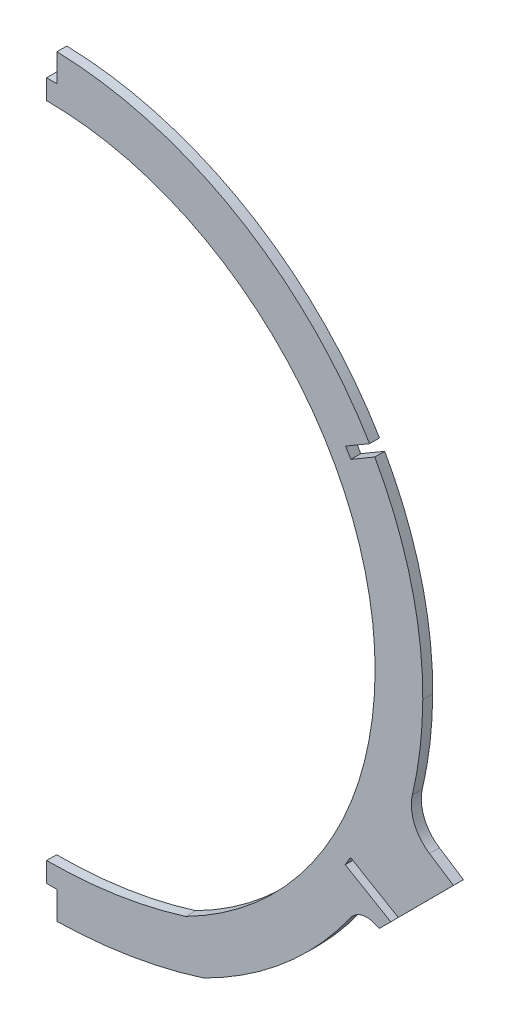
ISO-10303-21;
HEADER;
FILE_DESCRIPTION(('STEP AP214'),'2;1');
FILE_NAME('part.step','',(''),(''),'','','');
FILE_SCHEMA(('AUTOMOTIVE_DESIGN { 1 0 10303 214 1 1 1 1 }'));
ENDSEC;
DATA;
#1=APPLICATION_CONTEXT('core data for automotive mechanical design processes');
#2=APPLICATION_PROTOCOL_DEFINITION('international standard','automotive_design',2000,#1);
#3=PRODUCT_CONTEXT('',#1,'mechanical');
#4=PRODUCT('Part','Part','',(#3));
#5=PRODUCT_RELATED_PRODUCT_CATEGORY('part','',(#4));
#6=PRODUCT_DEFINITION_FORMATION('','',#4);
#7=PRODUCT_DEFINITION_CONTEXT('part definition',#1,'design');
#8=PRODUCT_DEFINITION('design','',#6,#7);
#9=PRODUCT_DEFINITION_SHAPE('','',#8);
#10=(LENGTH_UNIT() NAMED_UNIT(*) SI_UNIT(.MILLI.,.METRE.));
#11=(NAMED_UNIT(*) PLANE_ANGLE_UNIT() SI_UNIT($,.RADIAN.));
#12=(NAMED_UNIT(*) SI_UNIT($,.STERADIAN.) SOLID_ANGLE_UNIT());
#13=UNCERTAINTY_MEASURE_WITH_UNIT(LENGTH_MEASURE(1.E-05),#10,'distance_accuracy_value','');
#14=(GEOMETRIC_REPRESENTATION_CONTEXT(3) GLOBAL_UNCERTAINTY_ASSIGNED_CONTEXT((#13)) GLOBAL_UNIT_ASSIGNED_CONTEXT((#10,
#11,#12)) REPRESENTATION_CONTEXT('',''));
#15=CARTESIAN_POINT('',(0.,0.,0.));
#16=DIRECTION('',(0.,0.,1.));
#17=DIRECTION('',(1.,0.,0.));
#18=AXIS2_PLACEMENT_3D('',#15,#16,#17);
#19=CARTESIAN_POINT('',(0.0533981517267298,19.05,1.5875));
#20=DIRECTION('',(0.,0.,-1.));
#21=DIRECTION('',(-1.,0.,0.));
#22=AXIS2_PLACEMENT_3D('',#19,#20,#21);
#23=CYLINDRICAL_SURFACE('',#22,120.152293878386);
#24=CARTESIAN_POINT('',(0.0533981517267298,19.05,-1.5875));
#25=DIRECTION('',(0.,0.,1.));
#26=DIRECTION('',(-1.,0.,0.));
#27=AXIS2_PLACEMENT_3D('',#24,#25,#26);
#28=CIRCLE('',#27,120.152293878386);
#29=CARTESIAN_POINT('',(120.203613721784,18.3433015446214,-1.5875));
#30=VERTEX_POINT('',#29);
#31=CARTESIAN_POINT('',(104.86215862577,77.8011485175621,-1.5875));
#32=VERTEX_POINT('',#31);
#33=EDGE_CURVE('E347',#30,#32,#28,.T.);
#34=ORIENTED_EDGE('',*,*,#33,.T.);
#35=DIRECTION('',(0.,0.,-1.));
#36=VECTOR('',#35,1.);
#37=CARTESIAN_POINT('',(104.86215862577,77.8011485175621,1.5875));
#38=LINE('',#37,#36);
#39=CARTESIAN_POINT('',(104.86215862577,77.8011485175621,1.5875));
#40=VERTEX_POINT('',#39);
#41=EDGE_CURVE('E397',#32,#40,#38,.F.);
#42=ORIENTED_EDGE('',*,*,#41,.T.);
#43=CARTESIAN_POINT('',(0.0533981517267298,19.05,1.5875));
#44=DIRECTION('',(0.,0.,1.));
#45=DIRECTION('',(-1.,0.,0.));
#46=AXIS2_PLACEMENT_3D('',#43,#44,#45);
#47=CIRCLE('',#46,120.152293878386);
#48=CARTESIAN_POINT('',(120.203613721784,18.3433015446214,1.5875));
#49=VERTEX_POINT('',#48);
#50=EDGE_CURVE('E352',#49,#40,#47,.T.);
#51=ORIENTED_EDGE('',*,*,#50,.F.);
#52=DIRECTION('',(0.,0.,-1.));
#53=VECTOR('',#52,1.);
#54=CARTESIAN_POINT('',(120.203613721784,18.3433015446214,1.5875));
#55=LINE('',#54,#53);
#56=EDGE_CURVE('E355',#49,#30,#55,.T.);
#57=ORIENTED_EDGE('',*,*,#56,.T.);
#58=EDGE_LOOP('',(#34,#42,#51,#57));
#59=FACE_BOUND('',#58,.T.);
#60=ADVANCED_FACE('F36',(#59),#23,.T.);
#61=CARTESIAN_POINT('',(106.258152496254,-51.9886833193289,1.5875));
#62=DIRECTION('',(-0.708097112528265,0.70611506089952,0.));
#63=DIRECTION('',(-0.70611506089952,-0.708097112528265,0.));
#64=AXIS2_PLACEMENT_3D('',#61,#62,#63);
#65=PLANE('',#64);
#66=DIRECTION('',(0.70611506089952,0.708097112528265,0.));
#67=VECTOR('',#66,1.);
#68=CARTESIAN_POINT('',(106.258152496254,-51.9886833193289,-1.5875));
#69=LINE('',#68,#67);
#70=CARTESIAN_POINT('',(106.258152496254,-51.9886833193289,-1.5875));
#71=VERTEX_POINT('',#70);
#72=CARTESIAN_POINT('',(109.962976420149,-48.2734600247094,-1.5875));
#73=VERTEX_POINT('',#72);
#74=EDGE_CURVE('E304',#71,#73,#69,.T.);
#75=ORIENTED_EDGE('',*,*,#74,.T.);
#76=DIRECTION('',(0.,0.,1.));
#77=VECTOR('',#76,1.);
#78=CARTESIAN_POINT('',(109.962976420149,-48.2734600247095,1.5875));
#79=LINE('',#78,#77);
#80=CARTESIAN_POINT('',(109.962976420149,-48.2734600247094,1.5875));
#81=VERTEX_POINT('',#80);
#82=EDGE_CURVE('E392',#73,#81,#79,.T.);
#83=ORIENTED_EDGE('',*,*,#82,.T.);
#84=DIRECTION('',(0.70611506089952,0.708097112528265,0.));
#85=VECTOR('',#84,1.);
#86=CARTESIAN_POINT('',(106.258152496254,-51.9886833193289,1.5875));
#87=LINE('',#86,#85);
#88=CARTESIAN_POINT('',(106.258152496254,-51.9886833193289,1.5875));
#89=VERTEX_POINT('',#88);
#90=EDGE_CURVE('E295',#89,#81,#87,.T.);
#91=ORIENTED_EDGE('',*,*,#90,.F.);
#92=DIRECTION('',(0.,0.,-1.));
#93=VECTOR('',#92,1.);
#94=CARTESIAN_POINT('',(106.258152496254,-51.9886833193289,1.5875));
#95=LINE('',#94,#93);
#96=EDGE_CURVE('E311',#89,#71,#95,.T.);
#97=ORIENTED_EDGE('',*,*,#96,.T.);
#98=EDGE_LOOP('',(#75,#83,#91,#97));
#99=FACE_BOUND('',#98,.T.);
#100=ADVANCED_FACE('F449',(#99),#65,.F.);
#101=CARTESIAN_POINT('',(-5.64062361813422,19.0834910459425,1.5875));
#102=DIRECTION('',(0.,0.,-1.));
#103=DIRECTION('',(-1.,0.,0.));
#104=AXIS2_PLACEMENT_3D('',#101,#102,#103);
#105=CYLINDRICAL_SURFACE('',#104,125.846414141094);
#106=CARTESIAN_POINT('',(-5.64062361813422,19.0834910459425,-1.5875));
#107=DIRECTION('',(0.,0.,1.));
#108=DIRECTION('',(-1.,0.,0.));
#109=AXIS2_PLACEMENT_3D('',#106,#107,#108);
#110=CIRCLE('',#109,125.846414141094);
#111=CARTESIAN_POINT('',(50.138751442251,-93.726,-1.5875));
#112=VERTEX_POINT('',#111);
#113=CARTESIAN_POINT('',(97.1439741619348,-53.5294996056009,-1.5875));
#114=VERTEX_POINT('',#113);
#115=EDGE_CURVE('E358',#112,#114,#110,.T.);
#116=ORIENTED_EDGE('',*,*,#115,.T.);
#117=DIRECTION('',(0.,0.,-1.));
#118=VECTOR('',#117,1.);
#119=CARTESIAN_POINT('',(97.1439741619348,-53.5294996056009,1.5875));
#120=LINE('',#119,#118);
#121=CARTESIAN_POINT('',(97.1439741619348,-53.5294996056009,1.5875));
#122=VERTEX_POINT('',#121);
#123=EDGE_CURVE('E374',#114,#122,#120,.F.);
#124=ORIENTED_EDGE('',*,*,#123,.T.);
#125=CARTESIAN_POINT('',(-5.64062361813422,19.0834910459425,1.5875));
#126=DIRECTION('',(0.,0.,1.));
#127=DIRECTION('',(-1.,0.,0.));
#128=AXIS2_PLACEMENT_3D('',#125,#126,#127);
#129=CIRCLE('',#128,125.846414141094);
#130=CARTESIAN_POINT('',(50.138751442251,-93.726,1.5875));
#131=VERTEX_POINT('',#130);
#132=EDGE_CURVE('E348',#131,#122,#129,.T.);
#133=ORIENTED_EDGE('',*,*,#132,.F.);
#134=DIRECTION('',(0.,0.,-1.));
#135=VECTOR('',#134,1.);
#136=CARTESIAN_POINT('',(50.138751442251,-93.726,1.5875));
#137=LINE('',#136,#135);
#138=EDGE_CURVE('E366',#131,#112,#137,.T.);
#139=ORIENTED_EDGE('',*,*,#138,.T.);
#140=EDGE_LOOP('',(#116,#124,#133,#139));
#141=FACE_BOUND('',#140,.T.);
#142=ADVANCED_FACE('F461',(#141),#105,.T.);
#143=CARTESIAN_POINT('',(116.88560448143,-9.63311355601474,1.5875));
#144=VERTEX_POINT('',#143);
#145=EDGE_CURVE('E346',#144,#49,#129,.T.);
#146=ORIENTED_EDGE('',*,*,#145,.F.);
#147=DIRECTION('',(0.,0.,-1.));
#148=VECTOR('',#147,1.);
#149=CARTESIAN_POINT('',(116.88560448143,-9.63311355601474,1.5875));
#150=LINE('',#149,#148);
#151=CARTESIAN_POINT('',(116.88560448143,-9.63311355601474,-1.5875));
#152=VERTEX_POINT('',#151);
#153=EDGE_CURVE('E380',#144,#152,#150,.T.);
#154=ORIENTED_EDGE('',*,*,#153,.T.);
#155=EDGE_CURVE('E357',#152,#30,#110,.T.);
#156=ORIENTED_EDGE('',*,*,#155,.T.);
#157=ORIENTED_EDGE('',*,*,#56,.F.);
#158=EDGE_LOOP('',(#146,#154,#156,#157));
#159=FACE_BOUND('',#158,.T.);
#160=ADVANCED_FACE('F421',(#159),#105,.T.);
#161=CARTESIAN_POINT('',(2.87745258300709,41.275,1.5875));
#162=DIRECTION('',(0.,0.,1.));
#163=DIRECTION('',(1.,0.,0.));
#164=AXIS2_PLACEMENT_3D('',#161,#162,#163);
#165=PLANE('',#164);
#166=DIRECTION('',(0.,1.,0.));
#167=VECTOR('',#166,1.);
#168=CARTESIAN_POINT('',(3.302,130.312280289149,1.5875));
#169=LINE('',#168,#167);
#170=CARTESIAN_POINT('',(3.302,130.312280289149,1.5875));
#171=VERTEX_POINT('',#170);
#172=CARTESIAN_POINT('',(3.302,139.158369026765,1.5875));
#173=VERTEX_POINT('',#172);
#174=EDGE_CURVE('E229',#171,#173,#169,.T.);
#175=ORIENTED_EDGE('',*,*,#174,.F.);
#176=DIRECTION('',(1.,0.,0.));
#177=VECTOR('',#176,1.);
#178=CARTESIAN_POINT('',(0.,130.312280289149,1.5875));
#179=LINE('',#178,#177);
#180=CARTESIAN_POINT('',(0.,130.312280289149,1.5875));
#181=VERTEX_POINT('',#180);
#182=EDGE_CURVE('E211',#181,#171,#179,.T.);
#183=ORIENTED_EDGE('',*,*,#182,.F.);
#184=DIRECTION('',(0.,1.,0.));
#185=VECTOR('',#184,1.);
#186=CARTESIAN_POINT('',(0.,41.275,1.5875));
#187=LINE('',#186,#185);
#188=CARTESIAN_POINT('',(0.,123.962280289149,1.5875));
#189=VERTEX_POINT('',#188);
#190=EDGE_CURVE('E315',#189,#181,#187,.T.);
#191=ORIENTED_EDGE('',*,*,#190,.F.);
#192=CARTESIAN_POINT('',(0.0533981517267298,19.05,1.5875));
#193=DIRECTION('',(0.,0.,1.));
#194=DIRECTION('',(-1.,0.,0.));
#195=AXIS2_PLACEMENT_3D('',#192,#193,#194);
#196=CIRCLE('',#195,104.912293878419);
#197=CARTESIAN_POINT('',(104.963877332422,18.4329384888053,1.5875));
#198=VERTEX_POINT('',#197);
#199=EDGE_CURVE('E329',#198,#189,#196,.T.);
#200=ORIENTED_EDGE('',*,*,#199,.F.);
#201=CARTESIAN_POINT('',(-5.64062361813422,19.0834910459425,1.5875));
#202=DIRECTION('',(0.,0.,1.));
#203=DIRECTION('',(-1.,0.,0.));
#204=AXIS2_PLACEMENT_3D('',#201,#202,#203);
#205=CIRCLE('',#204,110.60641414112);
#206=CARTESIAN_POINT('',(44.4048605696805,-79.5533598849547,1.5875));
#207=VERTEX_POINT('',#206);
#208=EDGE_CURVE('E325',#207,#198,#205,.T.);
#209=ORIENTED_EDGE('',*,*,#208,.F.);
#210=CARTESIAN_POINT('',(0.0401740981522854,63.5,1.5875));
#211=DIRECTION('',(0.,0.,1.));
#212=DIRECTION('',(1.,0.,0.));
#213=AXIS2_PLACEMENT_3D('',#210,#211,#212);
#214=CIRCLE('',#213,149.774794875837);
#215=CARTESIAN_POINT('',(0.,-86.2747894878867,1.5875));
#216=VERTEX_POINT('',#215);
#217=EDGE_CURVE('E323',#216,#207,#214,.T.);
#218=ORIENTED_EDGE('',*,*,#217,.F.);
#219=CARTESIAN_POINT('',(0.,-92.6247894878867,1.5875));
#220=VERTEX_POINT('',#219);
#221=EDGE_CURVE('E320',#220,#216,#187,.T.);
#222=ORIENTED_EDGE('',*,*,#221,.F.);
#223=DIRECTION('',(-1.,0.,0.));
#224=VECTOR('',#223,1.);
#225=CARTESIAN_POINT('',(0.,-92.6247894878867,1.5875));
#226=LINE('',#225,#224);
#227=CARTESIAN_POINT('',(3.302,-92.6247894878867,1.5875));
#228=VERTEX_POINT('',#227);
#229=EDGE_CURVE('E283',#228,#220,#226,.T.);
#230=ORIENTED_EDGE('',*,*,#229,.F.);
#231=DIRECTION('',(0.,1.,0.));
#232=VECTOR('',#231,1.);
#233=CARTESIAN_POINT('',(3.302,-92.6247894878867,1.5875));
#234=LINE('',#233,#232);
#235=CARTESIAN_POINT('',(3.302,-101.48255368279,1.5875));
#236=VERTEX_POINT('',#235);
#237=EDGE_CURVE('E261',#236,#228,#234,.T.);
#238=ORIENTED_EDGE('',*,*,#237,.F.);
#239=CARTESIAN_POINT('',(0.0401740981522854,63.5,1.5875));
#240=DIRECTION('',(0.,0.,1.));
#241=DIRECTION('',(1.,0.,0.));
#242=AXIS2_PLACEMENT_3D('',#239,#240,#241);
#243=CIRCLE('',#242,165.014794875819);
#244=EDGE_CURVE('E344',#236,#131,#243,.T.);
#245=ORIENTED_EDGE('',*,*,#244,.T.);
#246=ORIENTED_EDGE('',*,*,#132,.T.);
#247=CARTESIAN_POINT('',(102.330313402175,-57.1934299113174,1.5875));
#248=DIRECTION('',(0.,0.,1.));
#249=DIRECTION('',(1.,0.,0.));
#250=AXIS2_PLACEMENT_3D('',#247,#248,#249);
#251=CIRCLE('',#250,6.35);
#252=CARTESIAN_POINT('',(104.903780740709,-51.3882799685941,1.5875));
#253=VERTEX_POINT('',#252);
#254=EDGE_CURVE('E378',#122,#253,#251,.F.);
#255=ORIENTED_EDGE('',*,*,#254,.T.);
#256=DIRECTION('',(0.914196841373741,-0.405270447013195,0.));
#257=VECTOR('',#256,1.);
#258=CARTESIAN_POINT('',(106.258152496254,-51.9886833193289,1.5875));
#259=LINE('',#258,#257);
#260=EDGE_CURVE('E291',#253,#89,#259,.T.);
#261=ORIENTED_EDGE('',*,*,#260,.T.);
#262=ORIENTED_EDGE('',*,*,#90,.T.);
#263=DIRECTION('',(0.862448043896424,-0.506145603141262,0.));
#264=VECTOR('',#263,1.);
#265=CARTESIAN_POINT('',(95.4242526258856,-39.741107060575,1.5875));
#266=LINE('',#265,#264);
#267=CARTESIAN_POINT('',(95.4242526258856,-39.741107060575,1.5875));
#268=VERTEX_POINT('',#267);
#269=EDGE_CURVE('E242',#268,#81,#266,.T.);
#270=ORIENTED_EDGE('',*,*,#269,.F.);
#271=DIRECTION('',(-0.506145603141263,-0.862448043896423,0.));
#272=VECTOR('',#271,1.);
#273=CARTESIAN_POINT('',(95.4242526258856,-39.741107060575,1.5875));
#274=LINE('',#273,#272);
#275=CARTESIAN_POINT('',(97.095545407458,-36.893303619629,1.5875));
#276=VERTEX_POINT('',#275);
#277=EDGE_CURVE('E262',#276,#268,#274,.T.);
#278=ORIENTED_EDGE('',*,*,#277,.F.);
#279=DIRECTION('',(-0.862448043896424,0.506145603141262,0.));
#280=VECTOR('',#279,1.);
#281=CARTESIAN_POINT('',(97.095545407458,-36.893303619629,1.5875));
#282=LINE('',#281,#280);
#283=CARTESIAN_POINT('',(112.371411886049,-45.8582641259811,1.5875));
#284=VERTEX_POINT('',#283);
#285=EDGE_CURVE('E265',#284,#276,#282,.T.);
#286=ORIENTED_EDGE('',*,*,#285,.F.);
#287=CARTESIAN_POINT('',(130.011728615408,-28.1684313610053,1.5875));
#288=VERTEX_POINT('',#287);
#289=EDGE_CURVE('E293',#284,#288,#87,.T.);
#290=ORIENTED_EDGE('',*,*,#289,.T.);
#291=DIRECTION('',(-0.838670567945427,0.544639035015022,0.));
#292=VECTOR('',#291,1.);
#293=CARTESIAN_POINT('',(130.011728615408,-28.1684313610053,1.5875));
#294=LINE('',#293,#292);
#295=CARTESIAN_POINT('',(122.333626645259,-23.1822136402457,1.5875));
#296=VERTEX_POINT('',#295);
#297=EDGE_CURVE('E298',#288,#296,#294,.T.);
#298=ORIENTED_EDGE('',*,*,#297,.T.);
#299=CARTESIAN_POINT('',(129.25054238995,-12.5310974273388,1.5875));
#300=DIRECTION('',(0.,0.,1.));
#301=DIRECTION('',(1.,0.,0.));
#302=AXIS2_PLACEMENT_3D('',#299,#300,#301);
#303=CIRCLE('',#302,12.7);
#304=EDGE_CURVE('E387',#296,#144,#303,.F.);
#305=ORIENTED_EDGE('',*,*,#304,.T.);
#306=ORIENTED_EDGE('',*,*,#145,.T.);
#307=ORIENTED_EDGE('',*,*,#50,.T.);
#308=DIRECTION('',(0.862448035610579,0.506145617259948,0.));
#309=VECTOR('',#308,1.);
#310=CARTESIAN_POINT('',(108.16621800195,79.7402046732599,1.5875));
#311=LINE('',#310,#309);
#312=CARTESIAN_POINT('',(97.2131279496957,73.3121553340585,1.5875));
#313=VERTEX_POINT('',#312);
#314=EDGE_CURVE('E233',#313,#40,#311,.T.);
#315=ORIENTED_EDGE('',*,*,#314,.F.);
#316=DIRECTION('',(0.506145617259947,-0.862448035610579,0.));
#317=VECTOR('',#316,1.);
#318=CARTESIAN_POINT('',(97.2131279496957,73.3121553340585,1.5875));
#319=LINE('',#318,#317);
#320=CARTESIAN_POINT('',(95.5418351215034,76.1599587476446,1.5875));
#321=VERTEX_POINT('',#320);
#322=EDGE_CURVE('E243',#321,#313,#319,.T.);
#323=ORIENTED_EDGE('',*,*,#322,.F.);
#324=DIRECTION('',(-0.862448035610579,-0.506145617259948,0.));
#325=VECTOR('',#324,1.);
#326=CARTESIAN_POINT('',(106.494925173758,82.588008086846,1.5875));
#327=LINE('',#326,#325);
#328=CARTESIAN_POINT('',(103.208114984354,80.6590749761637,1.5875));
#329=VERTEX_POINT('',#328);
#330=EDGE_CURVE('E246',#329,#321,#327,.T.);
#331=ORIENTED_EDGE('',*,*,#330,.F.);
#332=EDGE_CURVE('E351',#329,#173,#47,.T.);
#333=ORIENTED_EDGE('',*,*,#332,.T.);
#334=EDGE_LOOP('',(#175,#183,#191,#200,#209,#218,#222,#230,#238,#245,#246,#255,#261,#262,#270,
#278,#286,#290,#298,#305,#306,#307,#315,#323,#331,#333));
#335=FACE_BOUND('',#334,.T.);
#336=ADVANCED_FACE('F405',(#335),#165,.T.);
#337=CARTESIAN_POINT('',(2.87745258300709,41.275,-1.5875));
#338=DIRECTION('',(0.,0.,1.));
#339=DIRECTION('',(1.,0.,0.));
#340=AXIS2_PLACEMENT_3D('',#337,#338,#339);
#341=PLANE('',#340);
#342=DIRECTION('',(1.,0.,0.));
#343=VECTOR('',#342,1.);
#344=CARTESIAN_POINT('',(0.,130.312280289149,-1.5875));
#345=LINE('',#344,#343);
#346=CARTESIAN_POINT('',(0.,130.312280289149,-1.5875));
#347=VERTEX_POINT('',#346);
#348=CARTESIAN_POINT('',(3.302,130.312280289149,-1.5875));
#349=VERTEX_POINT('',#348);
#350=EDGE_CURVE('E59',#347,#349,#345,.T.);
#351=ORIENTED_EDGE('',*,*,#350,.T.);
#352=DIRECTION('',(0.,1.,0.));
#353=VECTOR('',#352,1.);
#354=CARTESIAN_POINT('',(3.302,130.312280289149,-1.5875));
#355=LINE('',#354,#353);
#356=CARTESIAN_POINT('',(3.302,139.158369026765,-1.5875));
#357=VERTEX_POINT('',#356);
#358=EDGE_CURVE('E218',#349,#357,#355,.T.);
#359=ORIENTED_EDGE('',*,*,#358,.T.);
#360=CARTESIAN_POINT('',(103.208114984354,80.6590749761637,-1.5875));
#361=VERTEX_POINT('',#360);
#362=EDGE_CURVE('E361',#361,#357,#28,.T.);
#363=ORIENTED_EDGE('',*,*,#362,.F.);
#364=DIRECTION('',(-0.862448035610579,-0.506145617259948,0.));
#365=VECTOR('',#364,1.);
#366=CARTESIAN_POINT('',(106.494925173758,82.588008086846,-1.5875));
#367=LINE('',#366,#365);
#368=CARTESIAN_POINT('',(95.5418351215034,76.1599587476446,-1.5875));
#369=VERTEX_POINT('',#368);
#370=EDGE_CURVE('E51',#361,#369,#367,.T.);
#371=ORIENTED_EDGE('',*,*,#370,.T.);
#372=DIRECTION('',(0.506145617259947,-0.862448035610579,0.));
#373=VECTOR('',#372,1.);
#374=CARTESIAN_POINT('',(97.2131279496957,73.3121553340585,-1.5875));
#375=LINE('',#374,#373);
#376=CARTESIAN_POINT('',(97.2131279496957,73.3121553340585,-1.5875));
#377=VERTEX_POINT('',#376);
#378=EDGE_CURVE('E239',#369,#377,#375,.T.);
#379=ORIENTED_EDGE('',*,*,#378,.T.);
#380=DIRECTION('',(0.862448035610579,0.506145617259948,0.));
#381=VECTOR('',#380,1.);
#382=CARTESIAN_POINT('',(108.16621800195,79.7402046732599,-1.5875));
#383=LINE('',#382,#381);
#384=EDGE_CURVE('E247',#377,#32,#383,.T.);
#385=ORIENTED_EDGE('',*,*,#384,.T.);
#386=ORIENTED_EDGE('',*,*,#33,.F.);
#387=ORIENTED_EDGE('',*,*,#155,.F.);
#388=CARTESIAN_POINT('',(129.25054238995,-12.5310974273388,-1.5875));
#389=DIRECTION('',(0.,0.,1.));
#390=DIRECTION('',(1.,0.,0.));
#391=AXIS2_PLACEMENT_3D('',#388,#389,#390);
#392=CIRCLE('',#391,12.7);
#393=CARTESIAN_POINT('',(122.333626645259,-23.1822136402457,-1.5875));
#394=VERTEX_POINT('',#393);
#395=EDGE_CURVE('E385',#152,#394,#392,.T.);
#396=ORIENTED_EDGE('',*,*,#395,.T.);
#397=DIRECTION('',(-0.838670567945427,0.544639035015022,0.));
#398=VECTOR('',#397,1.);
#399=CARTESIAN_POINT('',(130.011728615408,-28.1684313610053,-1.5875));
#400=LINE('',#399,#398);
#401=CARTESIAN_POINT('',(130.011728615408,-28.1684313610053,-1.5875));
#402=VERTEX_POINT('',#401);
#403=EDGE_CURVE('E294',#402,#394,#400,.T.);
#404=ORIENTED_EDGE('',*,*,#403,.F.);
#405=CARTESIAN_POINT('',(112.371411886049,-45.8582641259811,-1.5875));
#406=VERTEX_POINT('',#405);
#407=EDGE_CURVE('E303',#406,#402,#69,.T.);
#408=ORIENTED_EDGE('',*,*,#407,.F.);
#409=DIRECTION('',(-0.862448043896424,0.506145603141262,0.));
#410=VECTOR('',#409,1.);
#411=CARTESIAN_POINT('',(97.095545407458,-36.893303619629,-1.5875));
#412=LINE('',#411,#410);
#413=CARTESIAN_POINT('',(97.095545407458,-36.893303619629,-1.5875));
#414=VERTEX_POINT('',#413);
#415=EDGE_CURVE('E271',#406,#414,#412,.T.);
#416=ORIENTED_EDGE('',*,*,#415,.T.);
#417=DIRECTION('',(-0.506145603141263,-0.862448043896423,0.));
#418=VECTOR('',#417,1.);
#419=CARTESIAN_POINT('',(95.4242526258856,-39.741107060575,-1.5875));
#420=LINE('',#419,#418);
#421=CARTESIAN_POINT('',(95.4242526258856,-39.741107060575,-1.5875));
#422=VERTEX_POINT('',#421);
#423=EDGE_CURVE('E258',#414,#422,#420,.T.);
#424=ORIENTED_EDGE('',*,*,#423,.T.);
#425=DIRECTION('',(0.862448043896424,-0.506145603141262,0.));
#426=VECTOR('',#425,1.);
#427=CARTESIAN_POINT('',(95.4242526258856,-39.741107060575,-1.5875));
#428=LINE('',#427,#426);
#429=EDGE_CURVE('E266',#422,#73,#428,.T.);
#430=ORIENTED_EDGE('',*,*,#429,.T.);
#431=ORIENTED_EDGE('',*,*,#74,.F.);
#432=DIRECTION('',(0.914196841373741,-0.405270447013195,0.));
#433=VECTOR('',#432,1.);
#434=CARTESIAN_POINT('',(106.258152496254,-51.9886833193289,-1.5875));
#435=LINE('',#434,#433);
#436=CARTESIAN_POINT('',(104.903780740709,-51.3882799685941,-1.5875));
#437=VERTEX_POINT('',#436);
#438=EDGE_CURVE('E214',#437,#71,#435,.T.);
#439=ORIENTED_EDGE('',*,*,#438,.F.);
#440=CARTESIAN_POINT('',(102.330313402175,-57.1934299113174,-1.5875));
#441=DIRECTION('',(0.,0.,1.));
#442=DIRECTION('',(1.,0.,0.));
#443=AXIS2_PLACEMENT_3D('',#440,#441,#442);
#444=CIRCLE('',#443,6.35);
#445=EDGE_CURVE('E376',#437,#114,#444,.T.);
#446=ORIENTED_EDGE('',*,*,#445,.T.);
#447=ORIENTED_EDGE('',*,*,#115,.F.);
#448=CARTESIAN_POINT('',(0.0401740981522854,63.5,-1.5875));
#449=DIRECTION('',(0.,0.,1.));
#450=DIRECTION('',(1.,0.,0.));
#451=AXIS2_PLACEMENT_3D('',#448,#449,#450);
#452=CIRCLE('',#451,165.014794875819);
#453=CARTESIAN_POINT('',(3.302,-101.48255368279,-1.5875));
#454=VERTEX_POINT('',#453);
#455=EDGE_CURVE('E343',#454,#112,#452,.T.);
#456=ORIENTED_EDGE('',*,*,#455,.F.);
#457=DIRECTION('',(0.,1.,0.));
#458=VECTOR('',#457,1.);
#459=CARTESIAN_POINT('',(3.302,-92.6247894878867,-1.5875));
#460=LINE('',#459,#458);
#461=CARTESIAN_POINT('',(3.302,-92.6247894878867,-1.5875));
#462=VERTEX_POINT('',#461);
#463=EDGE_CURVE('E285',#454,#462,#460,.T.);
#464=ORIENTED_EDGE('',*,*,#463,.T.);
#465=DIRECTION('',(-1.,0.,0.));
#466=VECTOR('',#465,1.);
#467=CARTESIAN_POINT('',(0.,-92.6247894878867,-1.5875));
#468=LINE('',#467,#466);
#469=CARTESIAN_POINT('',(0.,-92.6247894878867,-1.5875));
#470=VERTEX_POINT('',#469);
#471=EDGE_CURVE('E279',#462,#470,#468,.T.);
#472=ORIENTED_EDGE('',*,*,#471,.T.);
#473=DIRECTION('',(0.,1.,0.));
#474=VECTOR('',#473,1.);
#475=CARTESIAN_POINT('',(0.,41.275,-1.5875));
#476=LINE('',#475,#474);
#477=CARTESIAN_POINT('',(0.,-86.2747894878867,-1.5875));
#478=VERTEX_POINT('',#477);
#479=EDGE_CURVE('E316',#470,#478,#476,.T.);
#480=ORIENTED_EDGE('',*,*,#479,.T.);
#481=CARTESIAN_POINT('',(0.0401740981522854,63.5,-1.5875));
#482=DIRECTION('',(0.,0.,1.));
#483=DIRECTION('',(1.,0.,0.));
#484=AXIS2_PLACEMENT_3D('',#481,#482,#483);
#485=CIRCLE('',#484,149.774794875837);
#486=CARTESIAN_POINT('',(44.4048605696805,-79.5533598849547,-1.5875));
#487=VERTEX_POINT('',#486);
#488=EDGE_CURVE('E333',#478,#487,#485,.T.);
#489=ORIENTED_EDGE('',*,*,#488,.T.);
#490=CARTESIAN_POINT('',(-5.64062361813422,19.0834910459425,-1.5875));
#491=DIRECTION('',(0.,0.,1.));
#492=DIRECTION('',(-1.,0.,0.));
#493=AXIS2_PLACEMENT_3D('',#490,#491,#492);
#494=CIRCLE('',#493,110.60641414112);
#495=CARTESIAN_POINT('',(104.963877332422,18.4329384888053,-1.5875));
#496=VERTEX_POINT('',#495);
#497=EDGE_CURVE('E335',#487,#496,#494,.T.);
#498=ORIENTED_EDGE('',*,*,#497,.T.);
#499=CARTESIAN_POINT('',(0.0533981517267298,19.05,-1.5875));
#500=DIRECTION('',(0.,0.,1.));
#501=DIRECTION('',(-1.,0.,0.));
#502=AXIS2_PLACEMENT_3D('',#499,#500,#501);
#503=CIRCLE('',#502,104.912293878419);
#504=CARTESIAN_POINT('',(0.,123.962280289149,-1.5875));
#505=VERTEX_POINT('',#504);
#506=EDGE_CURVE('E326',#496,#505,#503,.T.);
#507=ORIENTED_EDGE('',*,*,#506,.T.);
#508=EDGE_CURVE('E228',#505,#347,#476,.T.);
#509=ORIENTED_EDGE('',*,*,#508,.T.);
#510=EDGE_LOOP('',(#351,#359,#363,#371,#379,#385,#386,#387,#396,#404,#408,#416,#424,#430,#431,
#439,#446,#447,#456,#464,#472,#480,#489,#498,#507,#509));
#511=FACE_BOUND('',#510,.T.);
#512=ADVANCED_FACE('F226',(#511),#341,.F.);
#513=CARTESIAN_POINT('',(0.0401740981522854,63.5,1.5875));
#514=DIRECTION('',(0.,0.,-1.));
#515=DIRECTION('',(-1.,0.,0.));
#516=AXIS2_PLACEMENT_3D('',#513,#514,#515);
#517=CYLINDRICAL_SURFACE('',#516,165.014794875819);
#518=ORIENTED_EDGE('',*,*,#244,.F.);
#519=DIRECTION('',(0.,0.,-1.));
#520=VECTOR('',#519,1.);
#521=CARTESIAN_POINT('',(3.302,-101.48255368279,1.5875));
#522=LINE('',#521,#520);
#523=EDGE_CURVE('E11',#236,#454,#522,.T.);
#524=ORIENTED_EDGE('',*,*,#523,.T.);
#525=ORIENTED_EDGE('',*,*,#455,.T.);
#526=ORIENTED_EDGE('',*,*,#138,.F.);
#527=EDGE_LOOP('',(#518,#524,#525,#526));
#528=FACE_BOUND('',#527,.T.);
#529=ADVANCED_FACE('F470',(#528),#517,.T.);
#530=ORIENTED_EDGE('',*,*,#362,.T.);
#531=DIRECTION('',(0.,0.,-1.));
#532=VECTOR('',#531,1.);
#533=CARTESIAN_POINT('',(3.302,139.158369026765,1.5875));
#534=LINE('',#533,#532);
#535=EDGE_CURVE('E44',#357,#173,#534,.F.);
#536=ORIENTED_EDGE('',*,*,#535,.T.);
#537=ORIENTED_EDGE('',*,*,#332,.F.);
#538=DIRECTION('',(0.,0.,-1.));
#539=VECTOR('',#538,1.);
#540=CARTESIAN_POINT('',(103.208114984354,80.6590749761637,1.5875));
#541=LINE('',#540,#539);
#542=EDGE_CURVE('E395',#329,#361,#541,.T.);
#543=ORIENTED_EDGE('',*,*,#542,.T.);
#544=EDGE_LOOP('',(#530,#536,#537,#543));
#545=FACE_BOUND('',#544,.T.);
#546=ADVANCED_FACE('F402',(#545),#23,.T.);
#547=CARTESIAN_POINT('',(0.0401740981522854,63.5,1.5875));
#548=DIRECTION('',(0.,0.,-1.));
#549=DIRECTION('',(-1.,0.,0.));
#550=AXIS2_PLACEMENT_3D('',#547,#548,#549);
#551=CYLINDRICAL_SURFACE('',#550,149.774794875837);
#552=DIRECTION('',(0.,0.,-1.));
#553=VECTOR('',#552,1.);
#554=CARTESIAN_POINT('',(0.,-86.2747894878867,1.5875));
#555=LINE('',#554,#553);
#556=EDGE_CURVE('E319',#216,#478,#555,.T.);
#557=ORIENTED_EDGE('',*,*,#556,.F.);
#558=ORIENTED_EDGE('',*,*,#217,.T.);
#559=DIRECTION('',(0.,0.,-1.));
#560=VECTOR('',#559,1.);
#561=CARTESIAN_POINT('',(44.4048605696805,-79.5533598849547,1.5875));
#562=LINE('',#561,#560);
#563=EDGE_CURVE('E340',#207,#487,#562,.T.);
#564=ORIENTED_EDGE('',*,*,#563,.T.);
#565=ORIENTED_EDGE('',*,*,#488,.F.);
#566=EDGE_LOOP('',(#557,#558,#564,#565));
#567=FACE_BOUND('',#566,.T.);
#568=ADVANCED_FACE('F485',(#567),#551,.F.);
#569=CARTESIAN_POINT('',(-5.64062361813422,19.0834910459425,1.5875));
#570=DIRECTION('',(0.,0.,-1.));
#571=DIRECTION('',(-1.,0.,0.));
#572=AXIS2_PLACEMENT_3D('',#569,#570,#571);
#573=CYLINDRICAL_SURFACE('',#572,110.60641414112);
#574=ORIENTED_EDGE('',*,*,#497,.F.);
#575=ORIENTED_EDGE('',*,*,#563,.F.);
#576=ORIENTED_EDGE('',*,*,#208,.T.);
#577=DIRECTION('',(0.,0.,-1.));
#578=VECTOR('',#577,1.);
#579=CARTESIAN_POINT('',(104.963877332422,18.4329384888053,1.5875));
#580=LINE('',#579,#578);
#581=EDGE_CURVE('E332',#198,#496,#580,.T.);
#582=ORIENTED_EDGE('',*,*,#581,.T.);
#583=EDGE_LOOP('',(#574,#575,#576,#582));
#584=FACE_BOUND('',#583,.T.);
#585=ADVANCED_FACE('F489',(#584),#573,.F.);
#586=CARTESIAN_POINT('',(0.0533981517267298,19.05,1.5875));
#587=DIRECTION('',(0.,0.,-1.));
#588=DIRECTION('',(-1.,0.,0.));
#589=AXIS2_PLACEMENT_3D('',#586,#587,#588);
#590=CYLINDRICAL_SURFACE('',#589,104.912293878419);
#591=DIRECTION('',(0.,0.,-1.));
#592=VECTOR('',#591,1.);
#593=CARTESIAN_POINT('',(0.,123.962280289149,1.5875));
#594=LINE('',#593,#592);
#595=EDGE_CURVE('E369',#505,#189,#594,.F.);
#596=ORIENTED_EDGE('',*,*,#595,.F.);
#597=ORIENTED_EDGE('',*,*,#506,.F.);
#598=ORIENTED_EDGE('',*,*,#581,.F.);
#599=ORIENTED_EDGE('',*,*,#199,.T.);
#600=EDGE_LOOP('',(#596,#597,#598,#599));
#601=FACE_BOUND('',#600,.T.);
#602=ADVANCED_FACE('F493',(#601),#590,.F.);
#603=CARTESIAN_POINT('',(0.,0.,0.));
#604=DIRECTION('',(1.,0.,0.));
#605=DIRECTION('',(0.,0.,-1.));
#606=AXIS2_PLACEMENT_3D('',#603,#604,#605);
#607=PLANE('',#606);
#608=ORIENTED_EDGE('',*,*,#190,.T.);
#609=DIRECTION('',(0.,0.,1.));
#610=VECTOR('',#609,1.);
#611=CARTESIAN_POINT('',(0.,130.312280289149,-1.5875));
#612=LINE('',#611,#610);
#613=EDGE_CURVE('E215',#347,#181,#612,.T.);
#614=ORIENTED_EDGE('',*,*,#613,.F.);
#615=ORIENTED_EDGE('',*,*,#508,.F.);
#616=ORIENTED_EDGE('',*,*,#595,.T.);
#617=EDGE_LOOP('',(#608,#614,#615,#616));
#618=FACE_BOUND('',#617,.T.);
#619=ADVANCED_FACE('F497',(#618),#607,.F.);
#620=ORIENTED_EDGE('',*,*,#479,.F.);
#621=DIRECTION('',(0.,0.,1.));
#622=VECTOR('',#621,1.);
#623=CARTESIAN_POINT('',(0.,-92.6247894878867,-1.5875));
#624=LINE('',#623,#622);
#625=EDGE_CURVE('E280',#470,#220,#624,.T.);
#626=ORIENTED_EDGE('',*,*,#625,.T.);
#627=ORIENTED_EDGE('',*,*,#221,.T.);
#628=ORIENTED_EDGE('',*,*,#556,.T.);
#629=EDGE_LOOP('',(#620,#626,#627,#628));
#630=FACE_BOUND('',#629,.T.);
#631=ADVANCED_FACE('F479',(#630),#607,.F.);
#632=CARTESIAN_POINT('',(106.258152496254,-51.9886833193289,1.5875));
#633=DIRECTION('',(0.405270447013195,0.914196841373741,0.));
#634=DIRECTION('',(-0.914196841373741,0.405270447013195,0.));
#635=AXIS2_PLACEMENT_3D('',#632,#633,#634);
#636=PLANE('',#635);
#637=ORIENTED_EDGE('',*,*,#260,.F.);
#638=DIRECTION('',(0.,0.,1.));
#639=VECTOR('',#638,1.);
#640=CARTESIAN_POINT('',(104.903780740709,-51.3882799685941,-1.5875));
#641=LINE('',#640,#639);
#642=EDGE_CURVE('E371',#253,#437,#641,.F.);
#643=ORIENTED_EDGE('',*,*,#642,.T.);
#644=ORIENTED_EDGE('',*,*,#438,.T.);
#645=ORIENTED_EDGE('',*,*,#96,.F.);
#646=EDGE_LOOP('',(#637,#643,#644,#645));
#647=FACE_BOUND('',#646,.T.);
#648=ADVANCED_FACE('F454',(#647),#636,.F.);
#649=ORIENTED_EDGE('',*,*,#289,.F.);
#650=DIRECTION('',(0.,0.,-1.));
#651=VECTOR('',#650,1.);
#652=CARTESIAN_POINT('',(112.371411886049,-45.8582641259811,1.5875));
#653=LINE('',#652,#651);
#654=EDGE_CURVE('E389',#284,#406,#653,.T.);
#655=ORIENTED_EDGE('',*,*,#654,.T.);
#656=ORIENTED_EDGE('',*,*,#407,.T.);
#657=DIRECTION('',(0.,0.,-1.));
#658=VECTOR('',#657,1.);
#659=CARTESIAN_POINT('',(130.011728615408,-28.1684313610053,1.5875));
#660=LINE('',#659,#658);
#661=EDGE_CURVE('E301',#288,#402,#660,.T.);
#662=ORIENTED_EDGE('',*,*,#661,.F.);
#663=EDGE_LOOP('',(#649,#655,#656,#662));
#664=FACE_BOUND('',#663,.T.);
#665=ADVANCED_FACE('F436',(#664),#65,.F.);
#666=CARTESIAN_POINT('',(130.011728615408,-28.1684313610053,1.5875));
#667=DIRECTION('',(-0.544639035015022,-0.838670567945427,0.));
#668=DIRECTION('',(0.838670567945427,-0.544639035015022,0.));
#669=AXIS2_PLACEMENT_3D('',#666,#667,#668);
#670=PLANE('',#669);
#671=ORIENTED_EDGE('',*,*,#403,.T.);
#672=DIRECTION('',(0.,0.,1.));
#673=VECTOR('',#672,1.);
#674=CARTESIAN_POINT('',(122.333626645259,-23.1822136402457,1.5875));
#675=LINE('',#674,#673);
#676=EDGE_CURVE('E383',#394,#296,#675,.T.);
#677=ORIENTED_EDGE('',*,*,#676,.T.);
#678=ORIENTED_EDGE('',*,*,#297,.F.);
#679=ORIENTED_EDGE('',*,*,#661,.T.);
#680=EDGE_LOOP('',(#671,#677,#678,#679));
#681=FACE_BOUND('',#680,.T.);
#682=ADVANCED_FACE('F428',(#681),#670,.F.);
#683=CARTESIAN_POINT('',(102.330313402175,-57.1934299113174,1.5875));
#684=DIRECTION('',(0.,0.,-1.));
#685=DIRECTION('',(-1.,0.,0.));
#686=AXIS2_PLACEMENT_3D('',#683,#684,#685);
#687=CYLINDRICAL_SURFACE('',#686,6.35);
#688=ORIENTED_EDGE('',*,*,#254,.F.);
#689=ORIENTED_EDGE('',*,*,#123,.F.);
#690=ORIENTED_EDGE('',*,*,#445,.F.);
#691=ORIENTED_EDGE('',*,*,#642,.F.);
#692=EDGE_LOOP('',(#688,#689,#690,#691));
#693=FACE_BOUND('',#692,.T.);
#694=ADVANCED_FACE('F465',(#693),#687,.F.);
#695=CARTESIAN_POINT('',(129.25054238995,-12.5310974273388,1.5875));
#696=DIRECTION('',(0.,0.,-1.));
#697=DIRECTION('',(-1.,0.,0.));
#698=AXIS2_PLACEMENT_3D('',#695,#696,#697);
#699=CYLINDRICAL_SURFACE('',#698,12.7);
#700=ORIENTED_EDGE('',*,*,#304,.F.);
#701=ORIENTED_EDGE('',*,*,#676,.F.);
#702=ORIENTED_EDGE('',*,*,#395,.F.);
#703=ORIENTED_EDGE('',*,*,#153,.F.);
#704=EDGE_LOOP('',(#700,#701,#702,#703));
#705=FACE_BOUND('',#704,.T.);
#706=ADVANCED_FACE('F38',(#705),#699,.F.);
#707=CARTESIAN_POINT('',(95.4242526258856,-39.741107060575,-1.5875));
#708=DIRECTION('',(-0.506145603141262,-0.862448043896424,0.));
#709=DIRECTION('',(0.862448043896424,-0.506145603141262,0.));
#710=AXIS2_PLACEMENT_3D('',#707,#708,#709);
#711=PLANE('',#710);
#712=ORIENTED_EDGE('',*,*,#429,.F.);
#713=DIRECTION('',(0.,0.,1.));
#714=VECTOR('',#713,1.);
#715=CARTESIAN_POINT('',(95.4242526258856,-39.741107060575,-1.5875));
#716=LINE('',#715,#714);
#717=EDGE_CURVE('E259',#422,#268,#716,.T.);
#718=ORIENTED_EDGE('',*,*,#717,.T.);
#719=ORIENTED_EDGE('',*,*,#269,.T.);
#720=ORIENTED_EDGE('',*,*,#82,.F.);
#721=EDGE_LOOP('',(#712,#718,#719,#720));
#722=FACE_BOUND('',#721,.T.);
#723=ADVANCED_FACE('F445',(#722),#711,.F.);
#724=CARTESIAN_POINT('',(97.095545407458,-36.893303619629,-1.5875));
#725=DIRECTION('',(0.506145603141262,0.862448043896424,0.));
#726=DIRECTION('',(-0.862448043896424,0.506145603141262,0.));
#727=AXIS2_PLACEMENT_3D('',#724,#725,#726);
#728=PLANE('',#727);
#729=ORIENTED_EDGE('',*,*,#285,.T.);
#730=DIRECTION('',(0.,0.,1.));
#731=VECTOR('',#730,1.);
#732=CARTESIAN_POINT('',(97.095545407458,-36.893303619629,-1.5875));
#733=LINE('',#732,#731);
#734=EDGE_CURVE('E255',#414,#276,#733,.T.);
#735=ORIENTED_EDGE('',*,*,#734,.F.);
#736=ORIENTED_EDGE('',*,*,#415,.F.);
#737=ORIENTED_EDGE('',*,*,#654,.F.);
#738=EDGE_LOOP('',(#729,#735,#736,#737));
#739=FACE_BOUND('',#738,.T.);
#740=ADVANCED_FACE('F439',(#739),#728,.F.);
#741=CARTESIAN_POINT('',(95.4242526258856,-39.741107060575,-1.5875));
#742=DIRECTION('',(-0.862448043896423,0.506145603141263,0.));
#743=DIRECTION('',(-0.506145603141263,-0.862448043896423,0.));
#744=AXIS2_PLACEMENT_3D('',#741,#742,#743);
#745=PLANE('',#744);
#746=ORIENTED_EDGE('',*,*,#277,.T.);
#747=ORIENTED_EDGE('',*,*,#717,.F.);
#748=ORIENTED_EDGE('',*,*,#423,.F.);
#749=ORIENTED_EDGE('',*,*,#734,.T.);
#750=EDGE_LOOP('',(#746,#747,#748,#749));
#751=FACE_BOUND('',#750,.T.);
#752=ADVANCED_FACE('F441',(#751),#745,.F.);
#753=CARTESIAN_POINT('',(3.302,-92.6247894878867,-1.5875));
#754=DIRECTION('',(1.,0.,0.));
#755=DIRECTION('',(0.,0.,-1.));
#756=AXIS2_PLACEMENT_3D('',#753,#754,#755);
#757=PLANE('',#756);
#758=ORIENTED_EDGE('',*,*,#237,.T.);
#759=DIRECTION('',(0.,0.,1.));
#760=VECTOR('',#759,1.);
#761=CARTESIAN_POINT('',(3.302,-92.6247894878867,-1.5875));
#762=LINE('',#761,#760);
#763=EDGE_CURVE('E276',#462,#228,#762,.T.);
#764=ORIENTED_EDGE('',*,*,#763,.F.);
#765=ORIENTED_EDGE('',*,*,#463,.F.);
#766=ORIENTED_EDGE('',*,*,#523,.F.);
#767=EDGE_LOOP('',(#758,#764,#765,#766));
#768=FACE_BOUND('',#767,.T.);
#769=ADVANCED_FACE('F474',(#768),#757,.F.);
#770=CARTESIAN_POINT('',(0.,-92.6247894878867,-1.5875));
#771=DIRECTION('',(0.,1.,0.));
#772=DIRECTION('',(0.,0.,1.));
#773=AXIS2_PLACEMENT_3D('',#770,#771,#772);
#774=PLANE('',#773);
#775=ORIENTED_EDGE('',*,*,#229,.T.);
#776=ORIENTED_EDGE('',*,*,#625,.F.);
#777=ORIENTED_EDGE('',*,*,#471,.F.);
#778=ORIENTED_EDGE('',*,*,#763,.T.);
#779=EDGE_LOOP('',(#775,#776,#777,#778));
#780=FACE_BOUND('',#779,.T.);
#781=ADVANCED_FACE('F476',(#780),#774,.F.);
#782=CARTESIAN_POINT('',(3.302,130.312280289149,-1.5875));
#783=DIRECTION('',(1.,0.,0.));
#784=DIRECTION('',(0.,0.,-1.));
#785=AXIS2_PLACEMENT_3D('',#782,#783,#784);
#786=PLANE('',#785);
#787=ORIENTED_EDGE('',*,*,#358,.F.);
#788=DIRECTION('',(0.,0.,1.));
#789=VECTOR('',#788,1.);
#790=CARTESIAN_POINT('',(3.302,130.312280289149,-1.5875));
#791=LINE('',#790,#789);
#792=EDGE_CURVE('E207',#349,#171,#791,.T.);
#793=ORIENTED_EDGE('',*,*,#792,.T.);
#794=ORIENTED_EDGE('',*,*,#174,.T.);
#795=ORIENTED_EDGE('',*,*,#535,.F.);
#796=EDGE_LOOP('',(#787,#793,#794,#795));
#797=FACE_BOUND('',#796,.T.);
#798=ADVANCED_FACE('F219',(#797),#786,.F.);
#799=CARTESIAN_POINT('',(0.,130.312280289149,-1.5875));
#800=DIRECTION('',(0.,-1.,0.));
#801=DIRECTION('',(0.,0.,-1.));
#802=AXIS2_PLACEMENT_3D('',#799,#800,#801);
#803=PLANE('',#802);
#804=ORIENTED_EDGE('',*,*,#182,.T.);
#805=ORIENTED_EDGE('',*,*,#792,.F.);
#806=ORIENTED_EDGE('',*,*,#350,.F.);
#807=ORIENTED_EDGE('',*,*,#613,.T.);
#808=EDGE_LOOP('',(#804,#805,#806,#807));
#809=FACE_BOUND('',#808,.T.);
#810=ADVANCED_FACE('F209',(#809),#803,.F.);
#811=CARTESIAN_POINT('',(108.16621800195,79.7402046732599,-1.5875));
#812=DIRECTION('',(0.506145617259948,-0.862448035610579,0.));
#813=DIRECTION('',(0.862448035610579,0.506145617259948,0.));
#814=AXIS2_PLACEMENT_3D('',#811,#812,#813);
#815=PLANE('',#814);
#816=ORIENTED_EDGE('',*,*,#384,.F.);
#817=DIRECTION('',(0.,0.,1.));
#818=VECTOR('',#817,1.);
#819=CARTESIAN_POINT('',(97.2131279496957,73.3121553340585,-1.5875));
#820=LINE('',#819,#818);
#821=EDGE_CURVE('E240',#377,#313,#820,.T.);
#822=ORIENTED_EDGE('',*,*,#821,.T.);
#823=ORIENTED_EDGE('',*,*,#314,.T.);
#824=ORIENTED_EDGE('',*,*,#41,.F.);
#825=EDGE_LOOP('',(#816,#822,#823,#824));
#826=FACE_BOUND('',#825,.T.);
#827=ADVANCED_FACE('F611',(#826),#815,.F.);
#828=CARTESIAN_POINT('',(106.494925173758,82.588008086846,-1.5875));
#829=DIRECTION('',(-0.506145617259948,0.862448035610579,0.));
#830=DIRECTION('',(-0.862448035610579,-0.506145617259948,0.));
#831=AXIS2_PLACEMENT_3D('',#828,#829,#830);
#832=PLANE('',#831);
#833=ORIENTED_EDGE('',*,*,#330,.T.);
#834=DIRECTION('',(0.,0.,1.));
#835=VECTOR('',#834,1.);
#836=CARTESIAN_POINT('',(95.5418351215034,76.1599587476446,-1.5875));
#837=LINE('',#836,#835);
#838=EDGE_CURVE('E236',#369,#321,#837,.T.);
#839=ORIENTED_EDGE('',*,*,#838,.F.);
#840=ORIENTED_EDGE('',*,*,#370,.F.);
#841=ORIENTED_EDGE('',*,*,#542,.F.);
#842=EDGE_LOOP('',(#833,#839,#840,#841));
#843=FACE_BOUND('',#842,.T.);
#844=ADVANCED_FACE('F408',(#843),#832,.F.);
#845=CARTESIAN_POINT('',(97.2131279496957,73.3121553340585,-1.5875));
#846=DIRECTION('',(-0.862448035610579,-0.506145617259947,0.));
#847=DIRECTION('',(0.506145617259948,-0.862448035610579,0.));
#848=AXIS2_PLACEMENT_3D('',#845,#846,#847);
#849=PLANE('',#848);
#850=ORIENTED_EDGE('',*,*,#322,.T.);
#851=ORIENTED_EDGE('',*,*,#821,.F.);
#852=ORIENTED_EDGE('',*,*,#378,.F.);
#853=ORIENTED_EDGE('',*,*,#838,.T.);
#854=EDGE_LOOP('',(#850,#851,#852,#853));
#855=FACE_BOUND('',#854,.T.);
#856=ADVANCED_FACE('F411',(#855),#849,.F.);
#857=CLOSED_SHELL('',(#60,#100,#142,#160,#336,#512,#529,#546,#568,#585,#602,#619,#631,#648,#665,
#682,#694,#706,#723,#740,#752,#769,#781,#798,#810,#827,#844,#856));
#858=MANIFOLD_SOLID_BREP('B2',#857);
#859=ADVANCED_BREP_SHAPE_REPRESENTATION('',(#18,#858),#14);
#860=SHAPE_DEFINITION_REPRESENTATION(#9,#859);
ENDSEC;
END-ISO-10303-21;
